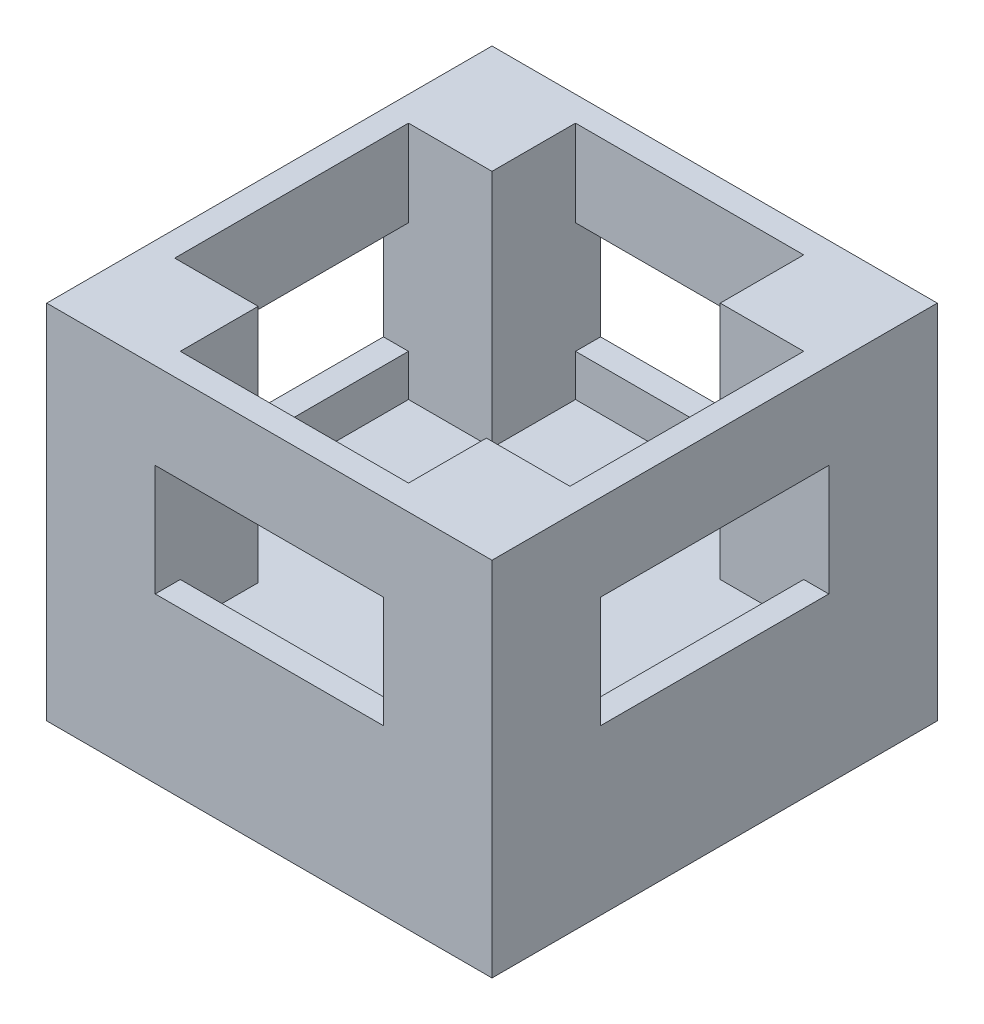
ISO-10303-21;
HEADER;
FILE_DESCRIPTION(('STEP AP214'),'2;1');
FILE_NAME('part.step','',(''),(''),'','','');
FILE_SCHEMA(('AUTOMOTIVE_DESIGN { 1 0 10303 214 1 1 1 1 }'));
ENDSEC;
DATA;
#1=APPLICATION_CONTEXT('core data for automotive mechanical design processes');
#2=APPLICATION_PROTOCOL_DEFINITION('international standard','automotive_design',2000,#1);
#3=PRODUCT_CONTEXT('',#1,'mechanical');
#4=PRODUCT('Part','Part','',(#3));
#5=PRODUCT_RELATED_PRODUCT_CATEGORY('part','',(#4));
#6=PRODUCT_DEFINITION_FORMATION('','',#4);
#7=PRODUCT_DEFINITION_CONTEXT('part definition',#1,'design');
#8=PRODUCT_DEFINITION('design','',#6,#7);
#9=PRODUCT_DEFINITION_SHAPE('','',#8);
#10=(LENGTH_UNIT() NAMED_UNIT(*) SI_UNIT(.MILLI.,.METRE.));
#11=(NAMED_UNIT(*) PLANE_ANGLE_UNIT() SI_UNIT($,.RADIAN.));
#12=(NAMED_UNIT(*) SI_UNIT($,.STERADIAN.) SOLID_ANGLE_UNIT());
#13=UNCERTAINTY_MEASURE_WITH_UNIT(LENGTH_MEASURE(1.E-05),#10,'distance_accuracy_value','');
#14=(GEOMETRIC_REPRESENTATION_CONTEXT(3) GLOBAL_UNCERTAINTY_ASSIGNED_CONTEXT((#13)) GLOBAL_UNIT_ASSIGNED_CONTEXT((#10,
#11,#12)) REPRESENTATION_CONTEXT('',''));
#15=CARTESIAN_POINT('',(0.,0.,0.));
#16=DIRECTION('',(0.,0.,1.));
#17=DIRECTION('',(1.,0.,0.));
#18=AXIS2_PLACEMENT_3D('',#15,#16,#17);
#19=CARTESIAN_POINT('',(0.,0.,-9.5885));
#20=DIRECTION('',(0.,0.,-1.));
#21=DIRECTION('',(-1.,0.,0.));
#22=AXIS2_PLACEMENT_3D('',#19,#20,#21);
#23=PLANE('',#22);
#24=DIRECTION('',(0.,-1.,0.));
#25=VECTOR('',#24,1.);
#26=CARTESIAN_POINT('',(2.4765,2.794,-9.5885));
#27=LINE('',#26,#25);
#28=CARTESIAN_POINT('',(2.4765,8.255,-9.5885));
#29=VERTEX_POINT('',#28);
#30=CARTESIAN_POINT('',(2.4765,6.2865,-9.5885));
#31=VERTEX_POINT('',#30);
#32=EDGE_CURVE('E373',#29,#31,#27,.T.);
#33=ORIENTED_EDGE('',*,*,#32,.T.);
#34=DIRECTION('',(1.,0.,0.));
#35=VECTOR('',#34,1.);
#36=CARTESIAN_POINT('',(3.302,6.2865,-9.5885));
#37=LINE('',#36,#35);
#38=CARTESIAN_POINT('',(7.6835,6.2865,-9.5885));
#39=VERTEX_POINT('',#38);
#40=EDGE_CURVE('E417',#31,#39,#37,.T.);
#41=ORIENTED_EDGE('',*,*,#40,.T.);
#42=DIRECTION('',(0.,1.,0.));
#43=VECTOR('',#42,1.);
#44=CARTESIAN_POINT('',(7.6835,2.794,-9.5885));
#45=LINE('',#44,#43);
#46=CARTESIAN_POINT('',(7.6835,8.255,-9.5885));
#47=VERTEX_POINT('',#46);
#48=EDGE_CURVE('E380',#39,#47,#45,.T.);
#49=ORIENTED_EDGE('',*,*,#48,.T.);
#50=DIRECTION('',(-1.,0.,0.));
#51=VECTOR('',#50,1.);
#52=CARTESIAN_POINT('',(2.4765,8.255,-9.5885));
#53=LINE('',#52,#51);
#54=EDGE_CURVE('E383',#47,#29,#53,.T.);
#55=ORIENTED_EDGE('',*,*,#54,.T.);
#56=EDGE_LOOP('',(#33,#41,#49,#55));
#57=FACE_BOUND('',#56,.T.);
#58=ADVANCED_FACE('F33',(#57),#23,.F.);
#59=CARTESIAN_POINT('',(0.,0.,-0.5715));
#60=DIRECTION('',(0.,0.,-1.));
#61=DIRECTION('',(-1.,0.,0.));
#62=AXIS2_PLACEMENT_3D('',#59,#60,#61);
#63=PLANE('',#62);
#64=DIRECTION('',(1.,0.,0.));
#65=VECTOR('',#64,1.);
#66=CARTESIAN_POINT('',(3.302,6.2865,-0.571500000000001));
#67=LINE('',#66,#65);
#68=CARTESIAN_POINT('',(2.4765,6.2865,-0.571500000000001));
#69=VERTEX_POINT('',#68);
#70=CARTESIAN_POINT('',(7.6835,6.2865,-0.571500000000001));
#71=VERTEX_POINT('',#70);
#72=EDGE_CURVE('E403',#69,#71,#67,.T.);
#73=ORIENTED_EDGE('',*,*,#72,.F.);
#74=DIRECTION('',(0.,-1.,0.));
#75=VECTOR('',#74,1.);
#76=CARTESIAN_POINT('',(2.4765,2.794,-0.5715));
#77=LINE('',#76,#75);
#78=CARTESIAN_POINT('',(2.4765,8.255,-0.5715));
#79=VERTEX_POINT('',#78);
#80=EDGE_CURVE('E387',#79,#69,#77,.T.);
#81=ORIENTED_EDGE('',*,*,#80,.F.);
#82=DIRECTION('',(-1.,0.,0.));
#83=VECTOR('',#82,1.);
#84=CARTESIAN_POINT('',(2.4765,8.255,-0.5715));
#85=LINE('',#84,#83);
#86=CARTESIAN_POINT('',(7.6835,8.255,-0.5715));
#87=VERTEX_POINT('',#86);
#88=EDGE_CURVE('E397',#87,#79,#85,.T.);
#89=ORIENTED_EDGE('',*,*,#88,.F.);
#90=DIRECTION('',(0.,1.,0.));
#91=VECTOR('',#90,1.);
#92=CARTESIAN_POINT('',(7.6835,2.794,-0.5715));
#93=LINE('',#92,#91);
#94=EDGE_CURVE('E393',#71,#87,#93,.T.);
#95=ORIENTED_EDGE('',*,*,#94,.F.);
#96=EDGE_LOOP('',(#73,#81,#89,#95));
#97=FACE_BOUND('',#96,.T.);
#98=ADVANCED_FACE('F526',(#97),#63,.T.);
#99=CARTESIAN_POINT('',(2.4765,2.794,-9.5885));
#100=DIRECTION('',(-1.,0.,0.));
#101=DIRECTION('',(0.,0.,1.));
#102=AXIS2_PLACEMENT_3D('',#99,#100,#101);
#103=PLANE('',#102);
#104=DIRECTION('',(0.,1.,0.));
#105=VECTOR('',#104,1.);
#106=CARTESIAN_POINT('',(2.4765,2.794,-2.3495));
#107=LINE('',#106,#105);
#108=CARTESIAN_POINT('',(2.4765,2.794,-2.3495));
#109=VERTEX_POINT('',#108);
#110=CARTESIAN_POINT('',(2.4765,8.255,-2.3495));
#111=VERTEX_POINT('',#110);
#112=EDGE_CURVE('E370',#109,#111,#107,.T.);
#113=ORIENTED_EDGE('',*,*,#112,.T.);
#114=DIRECTION('',(0.,0.,1.));
#115=VECTOR('',#114,1.);
#116=CARTESIAN_POINT('',(2.4765,8.255,-9.5885));
#117=LINE('',#116,#115);
#118=EDGE_CURVE('E404',#111,#79,#117,.T.);
#119=ORIENTED_EDGE('',*,*,#118,.T.);
#120=ORIENTED_EDGE('',*,*,#80,.T.);
#121=DIRECTION('',(0.,0.,1.));
#122=VECTOR('',#121,1.);
#123=CARTESIAN_POINT('',(2.4765,6.2865,-10.16));
#124=LINE('',#123,#122);
#125=CARTESIAN_POINT('',(2.4765,6.2865,0.));
#126=VERTEX_POINT('',#125);
#127=EDGE_CURVE('E305',#69,#126,#124,.T.);
#128=ORIENTED_EDGE('',*,*,#127,.T.);
#129=DIRECTION('',(0.,-1.,0.));
#130=VECTOR('',#129,1.);
#131=CARTESIAN_POINT('',(2.4765,6.2865,0.));
#132=LINE('',#131,#130);
#133=CARTESIAN_POINT('',(2.4765,3.7465,0.));
#134=VERTEX_POINT('',#133);
#135=EDGE_CURVE('E288',#126,#134,#132,.T.);
#136=ORIENTED_EDGE('',*,*,#135,.T.);
#137=DIRECTION('',(0.,0.,1.));
#138=VECTOR('',#137,1.);
#139=CARTESIAN_POINT('',(2.4765,3.7465,-10.16));
#140=LINE('',#139,#138);
#141=CARTESIAN_POINT('',(2.4765,3.7465,-0.571500000000001));
#142=VERTEX_POINT('',#141);
#143=EDGE_CURVE('E296',#142,#134,#140,.T.);
#144=ORIENTED_EDGE('',*,*,#143,.F.);
#145=CARTESIAN_POINT('',(2.4765,2.794,-0.5715));
#146=VERTEX_POINT('',#145);
#147=EDGE_CURVE('E372',#142,#146,#77,.T.);
#148=ORIENTED_EDGE('',*,*,#147,.T.);
#149=DIRECTION('',(0.,0.,1.));
#150=VECTOR('',#149,1.);
#151=CARTESIAN_POINT('',(2.4765,2.794,-9.5885));
#152=LINE('',#151,#150);
#153=EDGE_CURVE('E386',#109,#146,#152,.T.);
#154=ORIENTED_EDGE('',*,*,#153,.F.);
#155=EDGE_LOOP('',(#113,#119,#120,#128,#136,#144,#148,#154));
#156=FACE_BOUND('',#155,.T.);
#157=ADVANCED_FACE('F530',(#156),#103,.F.);
#158=CARTESIAN_POINT('',(7.6835,2.794,-9.5885));
#159=DIRECTION('',(1.,0.,0.));
#160=DIRECTION('',(0.,0.,-1.));
#161=AXIS2_PLACEMENT_3D('',#158,#159,#160);
#162=PLANE('',#161);
#163=CARTESIAN_POINT('',(7.6835,2.794,-0.5715));
#164=VERTEX_POINT('',#163);
#165=CARTESIAN_POINT('',(7.6835,3.7465,-0.5715));
#166=VERTEX_POINT('',#165);
#167=EDGE_CURVE('E394',#164,#166,#93,.T.);
#168=ORIENTED_EDGE('',*,*,#167,.T.);
#169=DIRECTION('',(0.,0.,1.));
#170=VECTOR('',#169,1.);
#171=CARTESIAN_POINT('',(7.6835,3.7465,-10.16));
#172=LINE('',#171,#170);
#173=CARTESIAN_POINT('',(7.6835,3.7465,0.));
#174=VERTEX_POINT('',#173);
#175=EDGE_CURVE('E313',#166,#174,#172,.T.);
#176=ORIENTED_EDGE('',*,*,#175,.T.);
#177=DIRECTION('',(0.,1.,0.));
#178=VECTOR('',#177,1.);
#179=CARTESIAN_POINT('',(7.6835,6.2865,0.));
#180=LINE('',#179,#178);
#181=CARTESIAN_POINT('',(7.6835,6.2865,0.));
#182=VERTEX_POINT('',#181);
#183=EDGE_CURVE('E293',#174,#182,#180,.T.);
#184=ORIENTED_EDGE('',*,*,#183,.T.);
#185=DIRECTION('',(0.,0.,1.));
#186=VECTOR('',#185,1.);
#187=CARTESIAN_POINT('',(7.6835,6.2865,-10.16));
#188=LINE('',#187,#186);
#189=EDGE_CURVE('E309',#71,#182,#188,.T.);
#190=ORIENTED_EDGE('',*,*,#189,.F.);
#191=ORIENTED_EDGE('',*,*,#94,.T.);
#192=DIRECTION('',(0.,0.,1.));
#193=VECTOR('',#192,1.);
#194=CARTESIAN_POINT('',(7.6835,8.255,-9.5885));
#195=LINE('',#194,#193);
#196=CARTESIAN_POINT('',(7.6835,8.255,-2.3495));
#197=VERTEX_POINT('',#196);
#198=EDGE_CURVE('E408',#197,#87,#195,.T.);
#199=ORIENTED_EDGE('',*,*,#198,.F.);
#200=DIRECTION('',(0.,-1.,0.));
#201=VECTOR('',#200,1.);
#202=CARTESIAN_POINT('',(7.6835,2.794,-2.3495));
#203=LINE('',#202,#201);
#204=CARTESIAN_POINT('',(7.6835,2.794,-2.3495));
#205=VERTEX_POINT('',#204);
#206=EDGE_CURVE('E368',#197,#205,#203,.T.);
#207=ORIENTED_EDGE('',*,*,#206,.T.);
#208=DIRECTION('',(0.,0.,1.));
#209=VECTOR('',#208,1.);
#210=CARTESIAN_POINT('',(7.6835,2.794,-9.5885));
#211=LINE('',#210,#209);
#212=EDGE_CURVE('E412',#205,#164,#211,.T.);
#213=ORIENTED_EDGE('',*,*,#212,.T.);
#214=EDGE_LOOP('',(#168,#176,#184,#190,#191,#199,#207,#213));
#215=FACE_BOUND('',#214,.T.);
#216=ADVANCED_FACE('F520',(#215),#162,.F.);
#217=CARTESIAN_POINT('',(3.302,6.2865,-10.16));
#218=DIRECTION('',(0.,-1.,0.));
#219=DIRECTION('',(0.,0.,-1.));
#220=AXIS2_PLACEMENT_3D('',#217,#218,#219);
#221=PLANE('',#220);
#222=DIRECTION('',(1.,0.,0.));
#223=VECTOR('',#222,1.);
#224=CARTESIAN_POINT('',(3.302,6.2865,0.));
#225=LINE('',#224,#223);
#226=EDGE_CURVE('E423',#126,#182,#225,.T.);
#227=ORIENTED_EDGE('',*,*,#226,.F.);
#228=ORIENTED_EDGE('',*,*,#127,.F.);
#229=ORIENTED_EDGE('',*,*,#72,.T.);
#230=ORIENTED_EDGE('',*,*,#189,.T.);
#231=EDGE_LOOP('',(#227,#228,#229,#230));
#232=FACE_BOUND('',#231,.T.);
#233=ADVANCED_FACE('F544',(#232),#221,.T.);
#234=CARTESIAN_POINT('',(3.302,3.7465,-10.16));
#235=DIRECTION('',(0.,-1.,0.));
#236=DIRECTION('',(0.,0.,-1.));
#237=AXIS2_PLACEMENT_3D('',#234,#235,#236);
#238=PLANE('',#237);
#239=DIRECTION('',(1.,0.,0.));
#240=VECTOR('',#239,1.);
#241=CARTESIAN_POINT('',(3.302,3.7465,-0.571500000000001));
#242=LINE('',#241,#240);
#243=EDGE_CURVE('E48',#142,#166,#242,.T.);
#244=ORIENTED_EDGE('',*,*,#243,.F.);
#245=ORIENTED_EDGE('',*,*,#143,.T.);
#246=DIRECTION('',(1.,0.,0.));
#247=VECTOR('',#246,1.);
#248=CARTESIAN_POINT('',(3.302,3.7465,0.));
#249=LINE('',#248,#247);
#250=EDGE_CURVE('E419',#134,#174,#249,.T.);
#251=ORIENTED_EDGE('',*,*,#250,.T.);
#252=ORIENTED_EDGE('',*,*,#175,.F.);
#253=EDGE_LOOP('',(#244,#245,#251,#252));
#254=FACE_BOUND('',#253,.T.);
#255=ADVANCED_FACE('F546',(#254),#238,.F.);
#256=CARTESIAN_POINT('',(0.,8.255,0.));
#257=DIRECTION('',(1.,0.,0.));
#258=DIRECTION('',(0.,0.,-1.));
#259=AXIS2_PLACEMENT_3D('',#256,#257,#258);
#260=PLANE('',#259);
#261=DIRECTION('',(0.,0.,1.));
#262=VECTOR('',#261,1.);
#263=CARTESIAN_POINT('',(0.,6.2865,-3.302));
#264=LINE('',#263,#262);
#265=CARTESIAN_POINT('',(0.,6.2865,-7.6835));
#266=VERTEX_POINT('',#265);
#267=CARTESIAN_POINT('',(0.,6.2865,-2.4765));
#268=VERTEX_POINT('',#267);
#269=EDGE_CURVE('E253',#266,#268,#264,.T.);
#270=ORIENTED_EDGE('',*,*,#269,.T.);
#271=DIRECTION('',(0.,-1.,0.));
#272=VECTOR('',#271,1.);
#273=CARTESIAN_POINT('',(0.,6.2865,-2.4765));
#274=LINE('',#273,#272);
#275=CARTESIAN_POINT('',(0.,3.7465,-2.4765));
#276=VERTEX_POINT('',#275);
#277=EDGE_CURVE('E261',#268,#276,#274,.T.);
#278=ORIENTED_EDGE('',*,*,#277,.T.);
#279=DIRECTION('',(0.,0.,-1.));
#280=VECTOR('',#279,1.);
#281=CARTESIAN_POINT('',(0.,3.7465,-3.302));
#282=LINE('',#281,#280);
#283=CARTESIAN_POINT('',(0.,3.7465,-7.6835));
#284=VERTEX_POINT('',#283);
#285=EDGE_CURVE('E243',#276,#284,#282,.T.);
#286=ORIENTED_EDGE('',*,*,#285,.T.);
#287=DIRECTION('',(0.,1.,0.));
#288=VECTOR('',#287,1.);
#289=CARTESIAN_POINT('',(0.,6.2865,-7.6835));
#290=LINE('',#289,#288);
#291=EDGE_CURVE('E267',#284,#266,#290,.T.);
#292=ORIENTED_EDGE('',*,*,#291,.T.);
#293=EDGE_LOOP('',(#270,#278,#286,#292));
#294=FACE_BOUND('',#293,.T.);
#295=DIRECTION('',(0.,0.,1.));
#296=VECTOR('',#295,1.);
#297=CARTESIAN_POINT('',(0.,0.,0.));
#298=LINE('',#297,#296);
#299=CARTESIAN_POINT('',(0.,0.,-10.16));
#300=VERTEX_POINT('',#299);
#301=CARTESIAN_POINT('',(0.,0.,0.));
#302=VERTEX_POINT('',#301);
#303=EDGE_CURVE('E425',#300,#302,#298,.T.);
#304=ORIENTED_EDGE('',*,*,#303,.T.);
#305=DIRECTION('',(0.,-1.,0.));
#306=VECTOR('',#305,1.);
#307=CARTESIAN_POINT('',(0.,8.255,0.));
#308=LINE('',#307,#306);
#309=CARTESIAN_POINT('',(0.,8.255,0.));
#310=VERTEX_POINT('',#309);
#311=EDGE_CURVE('E454',#310,#302,#308,.T.);
#312=ORIENTED_EDGE('',*,*,#311,.F.);
#313=DIRECTION('',(0.,0.,1.));
#314=VECTOR('',#313,1.);
#315=CARTESIAN_POINT('',(0.,8.255,0.));
#316=LINE('',#315,#314);
#317=CARTESIAN_POINT('',(0.,8.255,-10.16));
#318=VERTEX_POINT('',#317);
#319=EDGE_CURVE('E428',#318,#310,#316,.T.);
#320=ORIENTED_EDGE('',*,*,#319,.F.);
#321=DIRECTION('',(0.,-1.,0.));
#322=VECTOR('',#321,1.);
#323=CARTESIAN_POINT('',(0.,8.255,-10.16));
#324=LINE('',#323,#322);
#325=EDGE_CURVE('E438',#318,#300,#324,.T.);
#326=ORIENTED_EDGE('',*,*,#325,.T.);
#327=EDGE_LOOP('',(#304,#312,#320,#326));
#328=FACE_BOUND('',#327,.T.);
#329=ADVANCED_FACE('F35',(#294,#328),#260,.F.);
#330=CARTESIAN_POINT('',(0.,8.255,0.));
#331=DIRECTION('',(0.,0.,-1.));
#332=DIRECTION('',(-1.,0.,0.));
#333=AXIS2_PLACEMENT_3D('',#330,#331,#332);
#334=PLANE('',#333);
#335=ORIENTED_EDGE('',*,*,#226,.T.);
#336=ORIENTED_EDGE('',*,*,#183,.F.);
#337=ORIENTED_EDGE('',*,*,#250,.F.);
#338=ORIENTED_EDGE('',*,*,#135,.F.);
#339=EDGE_LOOP('',(#335,#336,#337,#338));
#340=FACE_BOUND('',#339,.T.);
#341=DIRECTION('',(1.,0.,0.));
#342=VECTOR('',#341,1.);
#343=CARTESIAN_POINT('',(0.,0.,0.));
#344=LINE('',#343,#342);
#345=CARTESIAN_POINT('',(10.16,0.,0.));
#346=VERTEX_POINT('',#345);
#347=EDGE_CURVE('E441',#302,#346,#344,.T.);
#348=ORIENTED_EDGE('',*,*,#347,.T.);
#349=DIRECTION('',(0.,-1.,0.));
#350=VECTOR('',#349,1.);
#351=CARTESIAN_POINT('',(10.16,8.255,0.));
#352=LINE('',#351,#350);
#353=CARTESIAN_POINT('',(10.16,8.255,0.));
#354=VERTEX_POINT('',#353);
#355=EDGE_CURVE('E451',#354,#346,#352,.T.);
#356=ORIENTED_EDGE('',*,*,#355,.F.);
#357=DIRECTION('',(1.,0.,0.));
#358=VECTOR('',#357,1.);
#359=CARTESIAN_POINT('',(0.,8.255,0.));
#360=LINE('',#359,#358);
#361=EDGE_CURVE('E431',#310,#354,#360,.T.);
#362=ORIENTED_EDGE('',*,*,#361,.F.);
#363=ORIENTED_EDGE('',*,*,#311,.T.);
#364=EDGE_LOOP('',(#348,#356,#362,#363));
#365=FACE_BOUND('',#364,.T.);
#366=ADVANCED_FACE('F539',(#340,#365),#334,.F.);
#367=CARTESIAN_POINT('',(10.16,8.255,0.));
#368=DIRECTION('',(-1.,0.,0.));
#369=DIRECTION('',(0.,0.,1.));
#370=AXIS2_PLACEMENT_3D('',#367,#368,#369);
#371=PLANE('',#370);
#372=DIRECTION('',(0.,0.,1.));
#373=VECTOR('',#372,1.);
#374=CARTESIAN_POINT('',(10.16,6.2865,-3.302));
#375=LINE('',#374,#373);
#376=CARTESIAN_POINT('',(10.16,6.2865,-7.6835));
#377=VERTEX_POINT('',#376);
#378=CARTESIAN_POINT('',(10.16,6.2865,-2.4765));
#379=VERTEX_POINT('',#378);
#380=EDGE_CURVE('E254',#377,#379,#375,.T.);
#381=ORIENTED_EDGE('',*,*,#380,.F.);
#382=DIRECTION('',(0.,1.,0.));
#383=VECTOR('',#382,1.);
#384=CARTESIAN_POINT('',(10.16,6.2865,-7.6835));
#385=LINE('',#384,#383);
#386=CARTESIAN_POINT('',(10.16,3.7465,-7.6835));
#387=VERTEX_POINT('',#386);
#388=EDGE_CURVE('E268',#387,#377,#385,.T.);
#389=ORIENTED_EDGE('',*,*,#388,.F.);
#390=DIRECTION('',(0.,0.,-1.));
#391=VECTOR('',#390,1.);
#392=CARTESIAN_POINT('',(10.16,3.7465,-3.302));
#393=LINE('',#392,#391);
#394=CARTESIAN_POINT('',(10.16,3.7465,-2.4765));
#395=VERTEX_POINT('',#394);
#396=EDGE_CURVE('E304',#395,#387,#393,.T.);
#397=ORIENTED_EDGE('',*,*,#396,.F.);
#398=DIRECTION('',(0.,-1.,0.));
#399=VECTOR('',#398,1.);
#400=CARTESIAN_POINT('',(10.16,6.2865,-2.4765));
#401=LINE('',#400,#399);
#402=EDGE_CURVE('E272',#379,#395,#401,.T.);
#403=ORIENTED_EDGE('',*,*,#402,.F.);
#404=EDGE_LOOP('',(#381,#389,#397,#403));
#405=FACE_BOUND('',#404,.T.);
#406=DIRECTION('',(0.,0.,-1.));
#407=VECTOR('',#406,1.);
#408=CARTESIAN_POINT('',(10.16,0.,0.));
#409=LINE('',#408,#407);
#410=CARTESIAN_POINT('',(10.16,0.,-10.16));
#411=VERTEX_POINT('',#410);
#412=EDGE_CURVE('E443',#346,#411,#409,.T.);
#413=ORIENTED_EDGE('',*,*,#412,.T.);
#414=DIRECTION('',(0.,-1.,0.));
#415=VECTOR('',#414,1.);
#416=CARTESIAN_POINT('',(10.16,8.255,-10.16));
#417=LINE('',#416,#415);
#418=CARTESIAN_POINT('',(10.16,8.255,-10.16));
#419=VERTEX_POINT('',#418);
#420=EDGE_CURVE('E448',#419,#411,#417,.T.);
#421=ORIENTED_EDGE('',*,*,#420,.F.);
#422=DIRECTION('',(0.,0.,-1.));
#423=VECTOR('',#422,1.);
#424=CARTESIAN_POINT('',(10.16,8.255,0.));
#425=LINE('',#424,#423);
#426=EDGE_CURVE('E434',#354,#419,#425,.T.);
#427=ORIENTED_EDGE('',*,*,#426,.F.);
#428=ORIENTED_EDGE('',*,*,#355,.T.);
#429=EDGE_LOOP('',(#413,#421,#427,#428));
#430=FACE_BOUND('',#429,.T.);
#431=ADVANCED_FACE('F584',(#405,#430),#371,.F.);
#432=CARTESIAN_POINT('',(0.,8.255,-10.16));
#433=DIRECTION('',(0.,0.,1.));
#434=DIRECTION('',(1.,0.,0.));
#435=AXIS2_PLACEMENT_3D('',#432,#433,#434);
#436=PLANE('',#435);
#437=DIRECTION('',(1.,0.,0.));
#438=VECTOR('',#437,1.);
#439=CARTESIAN_POINT('',(3.302,6.2865,-10.16));
#440=LINE('',#439,#438);
#441=CARTESIAN_POINT('',(2.4765,6.2865,-10.16));
#442=VERTEX_POINT('',#441);
#443=CARTESIAN_POINT('',(7.6835,6.2865,-10.16));
#444=VERTEX_POINT('',#443);
#445=EDGE_CURVE('E422',#442,#444,#440,.T.);
#446=ORIENTED_EDGE('',*,*,#445,.F.);
#447=DIRECTION('',(0.,-1.,0.));
#448=VECTOR('',#447,1.);
#449=CARTESIAN_POINT('',(2.4765,6.2865,-10.16));
#450=LINE('',#449,#448);
#451=CARTESIAN_POINT('',(2.4765,3.7465,-10.16));
#452=VERTEX_POINT('',#451);
#453=EDGE_CURVE('E289',#442,#452,#450,.T.);
#454=ORIENTED_EDGE('',*,*,#453,.T.);
#455=DIRECTION('',(1.,0.,0.));
#456=VECTOR('',#455,1.);
#457=CARTESIAN_POINT('',(3.302,3.7465,-10.16));
#458=LINE('',#457,#456);
#459=CARTESIAN_POINT('',(7.6835,3.7465,-10.16));
#460=VERTEX_POINT('',#459);
#461=EDGE_CURVE('E420',#452,#460,#458,.T.);
#462=ORIENTED_EDGE('',*,*,#461,.T.);
#463=DIRECTION('',(0.,1.,0.));
#464=VECTOR('',#463,1.);
#465=CARTESIAN_POINT('',(7.6835,6.2865,-10.16));
#466=LINE('',#465,#464);
#467=EDGE_CURVE('E292',#460,#444,#466,.T.);
#468=ORIENTED_EDGE('',*,*,#467,.T.);
#469=EDGE_LOOP('',(#446,#454,#462,#468));
#470=FACE_BOUND('',#469,.T.);
#471=DIRECTION('',(-1.,0.,0.));
#472=VECTOR('',#471,1.);
#473=CARTESIAN_POINT('',(0.,0.,-10.16));
#474=LINE('',#473,#472);
#475=EDGE_CURVE('E432',#411,#300,#474,.T.);
#476=ORIENTED_EDGE('',*,*,#475,.T.);
#477=ORIENTED_EDGE('',*,*,#325,.F.);
#478=DIRECTION('',(-1.,0.,0.));
#479=VECTOR('',#478,1.);
#480=CARTESIAN_POINT('',(0.,8.255,-10.16));
#481=LINE('',#480,#479);
#482=EDGE_CURVE('E436',#419,#318,#481,.T.);
#483=ORIENTED_EDGE('',*,*,#482,.F.);
#484=ORIENTED_EDGE('',*,*,#420,.T.);
#485=EDGE_LOOP('',(#476,#477,#483,#484));
#486=FACE_BOUND('',#485,.T.);
#487=ADVANCED_FACE('F580',(#470,#486),#436,.F.);
#488=CARTESIAN_POINT('',(0.,8.255,0.));
#489=DIRECTION('',(0.,-1.,0.));
#490=DIRECTION('',(0.,0.,-1.));
#491=AXIS2_PLACEMENT_3D('',#488,#489,#490);
#492=PLANE('',#491);
#493=ORIENTED_EDGE('',*,*,#118,.F.);
#494=DIRECTION('',(1.,0.,0.));
#495=VECTOR('',#494,1.);
#496=CARTESIAN_POINT('',(0.571500000000001,8.255,-2.3495));
#497=LINE('',#496,#495);
#498=CARTESIAN_POINT('',(0.571500000000001,8.255,-2.3495));
#499=VERTEX_POINT('',#498);
#500=EDGE_CURVE('E350',#499,#111,#497,.T.);
#501=ORIENTED_EDGE('',*,*,#500,.F.);
#502=DIRECTION('',(0.,0.,1.));
#503=VECTOR('',#502,1.);
#504=CARTESIAN_POINT('',(0.571500000000001,8.255,-2.3495));
#505=LINE('',#504,#503);
#506=CARTESIAN_POINT('',(0.571500000000001,8.255,-7.6835));
#507=VERTEX_POINT('',#506);
#508=EDGE_CURVE('E335',#507,#499,#505,.T.);
#509=ORIENTED_EDGE('',*,*,#508,.F.);
#510=DIRECTION('',(1.,0.,0.));
#511=VECTOR('',#510,1.);
#512=CARTESIAN_POINT('',(0.571500000000001,8.255,-7.6835));
#513=LINE('',#512,#511);
#514=CARTESIAN_POINT('',(2.4765,8.255,-7.6835));
#515=VERTEX_POINT('',#514);
#516=EDGE_CURVE('E355',#507,#515,#513,.T.);
#517=ORIENTED_EDGE('',*,*,#516,.T.);
#518=EDGE_CURVE('E400',#29,#515,#117,.T.);
#519=ORIENTED_EDGE('',*,*,#518,.F.);
#520=ORIENTED_EDGE('',*,*,#54,.F.);
#521=CARTESIAN_POINT('',(7.6835,8.255,-7.6835));
#522=VERTEX_POINT('',#521);
#523=EDGE_CURVE('E405',#47,#522,#195,.T.);
#524=ORIENTED_EDGE('',*,*,#523,.T.);
#525=CARTESIAN_POINT('',(9.5885,8.255,-7.6835));
#526=VERTEX_POINT('',#525);
#527=EDGE_CURVE('E358',#522,#526,#513,.T.);
#528=ORIENTED_EDGE('',*,*,#527,.T.);
#529=DIRECTION('',(0.,0.,1.));
#530=VECTOR('',#529,1.);
#531=CARTESIAN_POINT('',(9.5885,8.255,-2.3495));
#532=LINE('',#531,#530);
#533=CARTESIAN_POINT('',(9.5885,8.255,-2.3495));
#534=VERTEX_POINT('',#533);
#535=EDGE_CURVE('E328',#526,#534,#532,.T.);
#536=ORIENTED_EDGE('',*,*,#535,.T.);
#537=EDGE_CURVE('E354',#197,#534,#497,.T.);
#538=ORIENTED_EDGE('',*,*,#537,.F.);
#539=ORIENTED_EDGE('',*,*,#198,.T.);
#540=ORIENTED_EDGE('',*,*,#88,.T.);
#541=EDGE_LOOP('',(#493,#501,#509,#517,#519,#520,#524,#528,#536,#538,#539,#540));
#542=FACE_BOUND('',#541,.T.);
#543=ORIENTED_EDGE('',*,*,#319,.T.);
#544=ORIENTED_EDGE('',*,*,#361,.T.);
#545=ORIENTED_EDGE('',*,*,#426,.T.);
#546=ORIENTED_EDGE('',*,*,#482,.T.);
#547=EDGE_LOOP('',(#543,#544,#545,#546));
#548=FACE_BOUND('',#547,.T.);
#549=ADVANCED_FACE('F474',(#542,#548),#492,.F.);
#550=CARTESIAN_POINT('',(0.,0.,0.));
#551=DIRECTION('',(0.,-1.,0.));
#552=DIRECTION('',(0.,0.,-1.));
#553=AXIS2_PLACEMENT_3D('',#550,#551,#552);
#554=PLANE('',#553);
#555=ORIENTED_EDGE('',*,*,#303,.F.);
#556=ORIENTED_EDGE('',*,*,#475,.F.);
#557=ORIENTED_EDGE('',*,*,#412,.F.);
#558=ORIENTED_EDGE('',*,*,#347,.F.);
#559=EDGE_LOOP('',(#555,#556,#557,#558));
#560=FACE_BOUND('',#559,.T.);
#561=ADVANCED_FACE('F558',(#560),#554,.T.);
#562=ORIENTED_EDGE('',*,*,#40,.F.);
#563=EDGE_CURVE('E301',#442,#31,#124,.T.);
#564=ORIENTED_EDGE('',*,*,#563,.F.);
#565=ORIENTED_EDGE('',*,*,#445,.T.);
#566=EDGE_CURVE('E306',#444,#39,#188,.T.);
#567=ORIENTED_EDGE('',*,*,#566,.T.);
#568=EDGE_LOOP('',(#562,#564,#565,#567));
#569=FACE_BOUND('',#568,.T.);
#570=ADVANCED_FACE('F548',(#569),#221,.T.);
#571=ORIENTED_EDGE('',*,*,#461,.F.);
#572=CARTESIAN_POINT('',(2.4765,3.7465,-9.5885));
#573=VERTEX_POINT('',#572);
#574=EDGE_CURVE('E314',#452,#573,#140,.T.);
#575=ORIENTED_EDGE('',*,*,#574,.T.);
#576=DIRECTION('',(1.,0.,0.));
#577=VECTOR('',#576,1.);
#578=CARTESIAN_POINT('',(3.302,3.7465,-9.5885));
#579=LINE('',#578,#577);
#580=CARTESIAN_POINT('',(7.6835,3.7465,-9.5885));
#581=VERTEX_POINT('',#580);
#582=EDGE_CURVE('E56',#573,#581,#579,.T.);
#583=ORIENTED_EDGE('',*,*,#582,.T.);
#584=EDGE_CURVE('E310',#460,#581,#172,.T.);
#585=ORIENTED_EDGE('',*,*,#584,.F.);
#586=EDGE_LOOP('',(#571,#575,#583,#585));
#587=FACE_BOUND('',#586,.T.);
#588=ADVANCED_FACE('F554',(#587),#238,.F.);
#589=CARTESIAN_POINT('',(7.6835,2.794,-9.5885));
#590=VERTEX_POINT('',#589);
#591=EDGE_CURVE('E381',#590,#581,#45,.T.);
#592=ORIENTED_EDGE('',*,*,#591,.T.);
#593=ORIENTED_EDGE('',*,*,#582,.F.);
#594=CARTESIAN_POINT('',(2.4765,2.794,-9.5885));
#595=VERTEX_POINT('',#594);
#596=EDGE_CURVE('E377',#573,#595,#27,.T.);
#597=ORIENTED_EDGE('',*,*,#596,.T.);
#598=DIRECTION('',(1.,0.,0.));
#599=VECTOR('',#598,1.);
#600=CARTESIAN_POINT('',(2.4765,2.794,-9.5885));
#601=LINE('',#600,#599);
#602=EDGE_CURVE('E376',#595,#590,#601,.T.);
#603=ORIENTED_EDGE('',*,*,#602,.T.);
#604=EDGE_LOOP('',(#592,#593,#597,#603));
#605=FACE_BOUND('',#604,.T.);
#606=ADVANCED_FACE('F562',(#605),#23,.F.);
#607=ORIENTED_EDGE('',*,*,#243,.T.);
#608=ORIENTED_EDGE('',*,*,#167,.F.);
#609=DIRECTION('',(1.,0.,0.));
#610=VECTOR('',#609,1.);
#611=CARTESIAN_POINT('',(2.4765,2.794,-0.5715));
#612=LINE('',#611,#610);
#613=EDGE_CURVE('E390',#146,#164,#612,.T.);
#614=ORIENTED_EDGE('',*,*,#613,.F.);
#615=ORIENTED_EDGE('',*,*,#147,.F.);
#616=EDGE_LOOP('',(#607,#608,#614,#615));
#617=FACE_BOUND('',#616,.T.);
#618=ADVANCED_FACE('F534',(#617),#63,.T.);
#619=ORIENTED_EDGE('',*,*,#596,.F.);
#620=ORIENTED_EDGE('',*,*,#574,.F.);
#621=ORIENTED_EDGE('',*,*,#453,.F.);
#622=ORIENTED_EDGE('',*,*,#563,.T.);
#623=ORIENTED_EDGE('',*,*,#32,.F.);
#624=ORIENTED_EDGE('',*,*,#518,.T.);
#625=DIRECTION('',(0.,-1.,0.));
#626=VECTOR('',#625,1.);
#627=CARTESIAN_POINT('',(2.4765,2.794,-7.6835));
#628=LINE('',#627,#626);
#629=CARTESIAN_POINT('',(2.4765,2.794,-7.6835));
#630=VERTEX_POINT('',#629);
#631=EDGE_CURVE('E366',#515,#630,#628,.T.);
#632=ORIENTED_EDGE('',*,*,#631,.T.);
#633=EDGE_CURVE('E413',#595,#630,#152,.T.);
#634=ORIENTED_EDGE('',*,*,#633,.F.);
#635=EDGE_LOOP('',(#619,#620,#621,#622,#623,#624,#632,#634));
#636=FACE_BOUND('',#635,.T.);
#637=ADVANCED_FACE('F489',(#636),#103,.F.);
#638=DIRECTION('',(0.,1.,0.));
#639=VECTOR('',#638,1.);
#640=CARTESIAN_POINT('',(7.6835,2.794,-7.6835));
#641=LINE('',#640,#639);
#642=CARTESIAN_POINT('',(7.6835,2.794,-7.6835));
#643=VERTEX_POINT('',#642);
#644=EDGE_CURVE('E353',#643,#522,#641,.T.);
#645=ORIENTED_EDGE('',*,*,#644,.T.);
#646=ORIENTED_EDGE('',*,*,#523,.F.);
#647=ORIENTED_EDGE('',*,*,#48,.F.);
#648=ORIENTED_EDGE('',*,*,#566,.F.);
#649=ORIENTED_EDGE('',*,*,#467,.F.);
#650=ORIENTED_EDGE('',*,*,#584,.T.);
#651=ORIENTED_EDGE('',*,*,#591,.F.);
#652=EDGE_CURVE('E409',#590,#643,#211,.T.);
#653=ORIENTED_EDGE('',*,*,#652,.T.);
#654=EDGE_LOOP('',(#645,#646,#647,#648,#649,#650,#651,#653));
#655=FACE_BOUND('',#654,.T.);
#656=ADVANCED_FACE('F498',(#655),#162,.F.);
#657=CARTESIAN_POINT('',(2.4765,2.794,-9.5885));
#658=DIRECTION('',(0.,-1.,0.));
#659=DIRECTION('',(0.,0.,-1.));
#660=AXIS2_PLACEMENT_3D('',#657,#658,#659);
#661=PLANE('',#660);
#662=ORIENTED_EDGE('',*,*,#633,.T.);
#663=DIRECTION('',(1.,0.,0.));
#664=VECTOR('',#663,1.);
#665=CARTESIAN_POINT('',(0.571500000000001,2.794,-7.6835));
#666=LINE('',#665,#664);
#667=CARTESIAN_POINT('',(0.571500000000001,2.794,-7.6835));
#668=VERTEX_POINT('',#667);
#669=EDGE_CURVE('E359',#668,#630,#666,.T.);
#670=ORIENTED_EDGE('',*,*,#669,.F.);
#671=DIRECTION('',(0.,0.,-1.));
#672=VECTOR('',#671,1.);
#673=CARTESIAN_POINT('',(0.571500000000001,2.794,-2.3495));
#674=LINE('',#673,#672);
#675=CARTESIAN_POINT('',(0.571500000000001,2.794,-2.3495));
#676=VERTEX_POINT('',#675);
#677=EDGE_CURVE('E327',#676,#668,#674,.T.);
#678=ORIENTED_EDGE('',*,*,#677,.F.);
#679=DIRECTION('',(1.,0.,0.));
#680=VECTOR('',#679,1.);
#681=CARTESIAN_POINT('',(0.571500000000001,2.794,-2.3495));
#682=LINE('',#681,#680);
#683=EDGE_CURVE('E363',#676,#109,#682,.T.);
#684=ORIENTED_EDGE('',*,*,#683,.T.);
#685=ORIENTED_EDGE('',*,*,#153,.T.);
#686=ORIENTED_EDGE('',*,*,#613,.T.);
#687=ORIENTED_EDGE('',*,*,#212,.F.);
#688=CARTESIAN_POINT('',(9.5885,2.794,-2.3495));
#689=VERTEX_POINT('',#688);
#690=EDGE_CURVE('E338',#205,#689,#682,.T.);
#691=ORIENTED_EDGE('',*,*,#690,.T.);
#692=DIRECTION('',(0.,0.,-1.));
#693=VECTOR('',#692,1.);
#694=CARTESIAN_POINT('',(9.5885,2.794,-2.3495));
#695=LINE('',#694,#693);
#696=CARTESIAN_POINT('',(9.5885,2.794,-7.6835));
#697=VERTEX_POINT('',#696);
#698=EDGE_CURVE('E341',#689,#697,#695,.T.);
#699=ORIENTED_EDGE('',*,*,#698,.T.);
#700=EDGE_CURVE('E362',#643,#697,#666,.T.);
#701=ORIENTED_EDGE('',*,*,#700,.F.);
#702=ORIENTED_EDGE('',*,*,#652,.F.);
#703=ORIENTED_EDGE('',*,*,#602,.F.);
#704=EDGE_LOOP('',(#662,#670,#678,#684,#685,#686,#687,#691,#699,#701,#702,#703));
#705=FACE_BOUND('',#704,.T.);
#706=ADVANCED_FACE('F483',(#705),#661,.F.);
#707=CARTESIAN_POINT('',(0.571500000000001,2.794,-7.6835));
#708=DIRECTION('',(0.,0.,-1.));
#709=DIRECTION('',(-1.,0.,0.));
#710=AXIS2_PLACEMENT_3D('',#707,#708,#709);
#711=PLANE('',#710);
#712=DIRECTION('',(0.,1.,0.));
#713=VECTOR('',#712,1.);
#714=CARTESIAN_POINT('',(9.5885,2.794,-7.6835));
#715=LINE('',#714,#713);
#716=CARTESIAN_POINT('',(9.5885,3.7465,-7.6835));
#717=VERTEX_POINT('',#716);
#718=EDGE_CURVE('E345',#697,#717,#715,.T.);
#719=ORIENTED_EDGE('',*,*,#718,.T.);
#720=DIRECTION('',(1.,0.,0.));
#721=VECTOR('',#720,1.);
#722=CARTESIAN_POINT('',(0.,3.7465,-7.6835));
#723=LINE('',#722,#721);
#724=EDGE_CURVE('E262',#717,#387,#723,.T.);
#725=ORIENTED_EDGE('',*,*,#724,.T.);
#726=ORIENTED_EDGE('',*,*,#388,.T.);
#727=DIRECTION('',(1.,0.,0.));
#728=VECTOR('',#727,1.);
#729=CARTESIAN_POINT('',(0.,6.2865,-7.6835));
#730=LINE('',#729,#728);
#731=CARTESIAN_POINT('',(9.5885,6.2865,-7.6835));
#732=VERTEX_POINT('',#731);
#733=EDGE_CURVE('E284',#732,#377,#730,.T.);
#734=ORIENTED_EDGE('',*,*,#733,.F.);
#735=EDGE_CURVE('E344',#732,#526,#715,.T.);
#736=ORIENTED_EDGE('',*,*,#735,.T.);
#737=ORIENTED_EDGE('',*,*,#527,.F.);
#738=ORIENTED_EDGE('',*,*,#644,.F.);
#739=ORIENTED_EDGE('',*,*,#700,.T.);
#740=EDGE_LOOP('',(#719,#725,#726,#734,#736,#737,#738,#739));
#741=FACE_BOUND('',#740,.T.);
#742=ADVANCED_FACE('F503',(#741),#711,.F.);
#743=CARTESIAN_POINT('',(0.571500000000001,2.794,-2.3495));
#744=DIRECTION('',(0.,0.,1.));
#745=DIRECTION('',(1.,0.,0.));
#746=AXIS2_PLACEMENT_3D('',#743,#744,#745);
#747=PLANE('',#746);
#748=ORIENTED_EDGE('',*,*,#537,.T.);
#749=DIRECTION('',(0.,-1.,0.));
#750=VECTOR('',#749,1.);
#751=CARTESIAN_POINT('',(9.5885,2.794,-2.3495));
#752=LINE('',#751,#750);
#753=EDGE_CURVE('E323',#534,#689,#752,.T.);
#754=ORIENTED_EDGE('',*,*,#753,.T.);
#755=ORIENTED_EDGE('',*,*,#690,.F.);
#756=ORIENTED_EDGE('',*,*,#206,.F.);
#757=EDGE_LOOP('',(#748,#754,#755,#756));
#758=FACE_BOUND('',#757,.T.);
#759=ADVANCED_FACE('F517',(#758),#747,.F.);
#760=CARTESIAN_POINT('',(9.5885,0.,0.));
#761=DIRECTION('',(-1.,0.,0.));
#762=DIRECTION('',(0.,0.,1.));
#763=AXIS2_PLACEMENT_3D('',#760,#761,#762);
#764=PLANE('',#763);
#765=ORIENTED_EDGE('',*,*,#735,.F.);
#766=DIRECTION('',(0.,0.,-1.));
#767=VECTOR('',#766,1.);
#768=CARTESIAN_POINT('',(9.5885,6.2865,0.));
#769=LINE('',#768,#767);
#770=CARTESIAN_POINT('',(9.5885,6.2865,-2.4765));
#771=VERTEX_POINT('',#770);
#772=EDGE_CURVE('E321',#771,#732,#769,.T.);
#773=ORIENTED_EDGE('',*,*,#772,.F.);
#774=DIRECTION('',(0.,1.,0.));
#775=VECTOR('',#774,1.);
#776=CARTESIAN_POINT('',(9.5885,0.,-2.4765));
#777=LINE('',#776,#775);
#778=CARTESIAN_POINT('',(9.5885,3.7465,-2.4765));
#779=VERTEX_POINT('',#778);
#780=EDGE_CURVE('E279',#779,#771,#777,.T.);
#781=ORIENTED_EDGE('',*,*,#780,.F.);
#782=DIRECTION('',(0.,0.,1.));
#783=VECTOR('',#782,1.);
#784=CARTESIAN_POINT('',(9.5885,3.7465,0.));
#785=LINE('',#784,#783);
#786=EDGE_CURVE('E317',#717,#779,#785,.T.);
#787=ORIENTED_EDGE('',*,*,#786,.F.);
#788=ORIENTED_EDGE('',*,*,#718,.F.);
#789=ORIENTED_EDGE('',*,*,#698,.F.);
#790=ORIENTED_EDGE('',*,*,#753,.F.);
#791=ORIENTED_EDGE('',*,*,#535,.F.);
#792=EDGE_LOOP('',(#765,#773,#781,#787,#788,#789,#790,#791));
#793=FACE_BOUND('',#792,.T.);
#794=ADVANCED_FACE('F512',(#793),#764,.T.);
#795=ORIENTED_EDGE('',*,*,#683,.F.);
#796=DIRECTION('',(0.,-1.,0.));
#797=VECTOR('',#796,1.);
#798=CARTESIAN_POINT('',(0.571500000000001,2.794,-2.3495));
#799=LINE('',#798,#797);
#800=EDGE_CURVE('E324',#499,#676,#799,.T.);
#801=ORIENTED_EDGE('',*,*,#800,.F.);
#802=ORIENTED_EDGE('',*,*,#500,.T.);
#803=ORIENTED_EDGE('',*,*,#112,.F.);
#804=EDGE_LOOP('',(#795,#801,#802,#803));
#805=FACE_BOUND('',#804,.T.);
#806=ADVANCED_FACE('F478',(#805),#747,.F.);
#807=ORIENTED_EDGE('',*,*,#669,.T.);
#808=ORIENTED_EDGE('',*,*,#631,.F.);
#809=ORIENTED_EDGE('',*,*,#516,.F.);
#810=DIRECTION('',(0.,1.,0.));
#811=VECTOR('',#810,1.);
#812=CARTESIAN_POINT('',(0.571500000000001,2.794,-7.6835));
#813=LINE('',#812,#811);
#814=CARTESIAN_POINT('',(0.571500000000001,6.2865,-7.6835));
#815=VERTEX_POINT('',#814);
#816=EDGE_CURVE('E331',#815,#507,#813,.T.);
#817=ORIENTED_EDGE('',*,*,#816,.F.);
#818=EDGE_CURVE('E281',#266,#815,#730,.T.);
#819=ORIENTED_EDGE('',*,*,#818,.F.);
#820=ORIENTED_EDGE('',*,*,#291,.F.);
#821=CARTESIAN_POINT('',(0.571500000000001,3.7465,-7.6835));
#822=VERTEX_POINT('',#821);
#823=EDGE_CURVE('E248',#284,#822,#723,.T.);
#824=ORIENTED_EDGE('',*,*,#823,.T.);
#825=EDGE_CURVE('E332',#668,#822,#813,.T.);
#826=ORIENTED_EDGE('',*,*,#825,.F.);
#827=EDGE_LOOP('',(#807,#808,#809,#817,#819,#820,#824,#826));
#828=FACE_BOUND('',#827,.T.);
#829=ADVANCED_FACE('F468',(#828),#711,.F.);
#830=CARTESIAN_POINT('',(0.571500000000001,0.,0.));
#831=DIRECTION('',(-1.,0.,0.));
#832=DIRECTION('',(0.,0.,1.));
#833=AXIS2_PLACEMENT_3D('',#830,#831,#832);
#834=PLANE('',#833);
#835=DIRECTION('',(0.,0.,-1.));
#836=VECTOR('',#835,1.);
#837=CARTESIAN_POINT('',(0.571500000000001,6.2865,0.));
#838=LINE('',#837,#836);
#839=CARTESIAN_POINT('',(0.571500000000001,6.2865,-2.4765));
#840=VERTEX_POINT('',#839);
#841=EDGE_CURVE('E41',#840,#815,#838,.T.);
#842=ORIENTED_EDGE('',*,*,#841,.T.);
#843=ORIENTED_EDGE('',*,*,#816,.T.);
#844=ORIENTED_EDGE('',*,*,#508,.T.);
#845=ORIENTED_EDGE('',*,*,#800,.T.);
#846=ORIENTED_EDGE('',*,*,#677,.T.);
#847=ORIENTED_EDGE('',*,*,#825,.T.);
#848=DIRECTION('',(0.,0.,1.));
#849=VECTOR('',#848,1.);
#850=CARTESIAN_POINT('',(0.571500000000001,3.7465,0.));
#851=LINE('',#850,#849);
#852=CARTESIAN_POINT('',(0.571500000000001,3.7465,-2.4765));
#853=VERTEX_POINT('',#852);
#854=EDGE_CURVE('E459',#822,#853,#851,.T.);
#855=ORIENTED_EDGE('',*,*,#854,.T.);
#856=DIRECTION('',(0.,1.,0.));
#857=VECTOR('',#856,1.);
#858=CARTESIAN_POINT('',(0.571500000000001,0.,-2.4765));
#859=LINE('',#858,#857);
#860=EDGE_CURVE('E11',#853,#840,#859,.T.);
#861=ORIENTED_EDGE('',*,*,#860,.T.);
#862=EDGE_LOOP('',(#842,#843,#844,#845,#846,#847,#855,#861));
#863=FACE_BOUND('',#862,.T.);
#864=ADVANCED_FACE('F461',(#863),#834,.F.);
#865=CARTESIAN_POINT('',(0.,3.7465,-3.302));
#866=DIRECTION('',(0.,-1.,0.));
#867=DIRECTION('',(0.,0.,-1.));
#868=AXIS2_PLACEMENT_3D('',#865,#866,#867);
#869=PLANE('',#868);
#870=ORIENTED_EDGE('',*,*,#854,.F.);
#871=ORIENTED_EDGE('',*,*,#823,.F.);
#872=ORIENTED_EDGE('',*,*,#285,.F.);
#873=DIRECTION('',(1.,0.,0.));
#874=VECTOR('',#873,1.);
#875=CARTESIAN_POINT('',(0.,3.7465,-2.4765));
#876=LINE('',#875,#874);
#877=EDGE_CURVE('E246',#276,#853,#876,.T.);
#878=ORIENTED_EDGE('',*,*,#877,.T.);
#879=EDGE_LOOP('',(#870,#871,#872,#878));
#880=FACE_BOUND('',#879,.T.);
#881=ADVANCED_FACE('F245',(#880),#869,.F.);
#882=CARTESIAN_POINT('',(0.,6.2865,-3.302));
#883=DIRECTION('',(0.,1.,0.));
#884=DIRECTION('',(0.,0.,1.));
#885=AXIS2_PLACEMENT_3D('',#882,#883,#884);
#886=PLANE('',#885);
#887=ORIENTED_EDGE('',*,*,#841,.F.);
#888=DIRECTION('',(1.,0.,0.));
#889=VECTOR('',#888,1.);
#890=CARTESIAN_POINT('',(0.,6.2865,-2.4765));
#891=LINE('',#890,#889);
#892=EDGE_CURVE('E277',#268,#840,#891,.T.);
#893=ORIENTED_EDGE('',*,*,#892,.F.);
#894=ORIENTED_EDGE('',*,*,#269,.F.);
#895=ORIENTED_EDGE('',*,*,#818,.T.);
#896=EDGE_LOOP('',(#887,#893,#894,#895));
#897=FACE_BOUND('',#896,.T.);
#898=ADVANCED_FACE('F466',(#897),#886,.F.);
#899=ORIENTED_EDGE('',*,*,#772,.T.);
#900=ORIENTED_EDGE('',*,*,#733,.T.);
#901=ORIENTED_EDGE('',*,*,#380,.T.);
#902=EDGE_CURVE('E280',#771,#379,#891,.T.);
#903=ORIENTED_EDGE('',*,*,#902,.F.);
#904=EDGE_LOOP('',(#899,#900,#901,#903));
#905=FACE_BOUND('',#904,.T.);
#906=ADVANCED_FACE('F676',(#905),#886,.F.);
#907=ORIENTED_EDGE('',*,*,#786,.T.);
#908=EDGE_CURVE('E263',#779,#395,#876,.T.);
#909=ORIENTED_EDGE('',*,*,#908,.T.);
#910=ORIENTED_EDGE('',*,*,#396,.T.);
#911=ORIENTED_EDGE('',*,*,#724,.F.);
#912=EDGE_LOOP('',(#907,#909,#910,#911));
#913=FACE_BOUND('',#912,.T.);
#914=ADVANCED_FACE('F670',(#913),#869,.F.);
#915=CARTESIAN_POINT('',(0.,6.2865,-2.4765));
#916=DIRECTION('',(0.,0.,1.));
#917=DIRECTION('',(0.,-1.,0.));
#918=AXIS2_PLACEMENT_3D('',#915,#916,#917);
#919=PLANE('',#918);
#920=ORIENTED_EDGE('',*,*,#780,.T.);
#921=ORIENTED_EDGE('',*,*,#902,.T.);
#922=ORIENTED_EDGE('',*,*,#402,.T.);
#923=ORIENTED_EDGE('',*,*,#908,.F.);
#924=EDGE_LOOP('',(#920,#921,#922,#923));
#925=FACE_BOUND('',#924,.T.);
#926=ADVANCED_FACE('F689',(#925),#919,.F.);
#927=ORIENTED_EDGE('',*,*,#877,.F.);
#928=ORIENTED_EDGE('',*,*,#277,.F.);
#929=ORIENTED_EDGE('',*,*,#892,.T.);
#930=ORIENTED_EDGE('',*,*,#860,.F.);
#931=EDGE_LOOP('',(#927,#928,#929,#930));
#932=FACE_BOUND('',#931,.T.);
#933=ADVANCED_FACE('F259',(#932),#919,.F.);
#934=CLOSED_SHELL('',(#58,#98,#157,#216,#233,#255,#329,#366,#431,#487,#549,#561,#570,#588,#606,
#618,#637,#656,#706,#742,#759,#794,#806,#829,#864,#881,#898,#906,#914,#926,#933));
#935=MANIFOLD_SOLID_BREP('B2',#934);
#936=ADVANCED_BREP_SHAPE_REPRESENTATION('',(#18,#935),#14);
#937=SHAPE_DEFINITION_REPRESENTATION(#9,#936);
ENDSEC;
END-ISO-10303-21;
